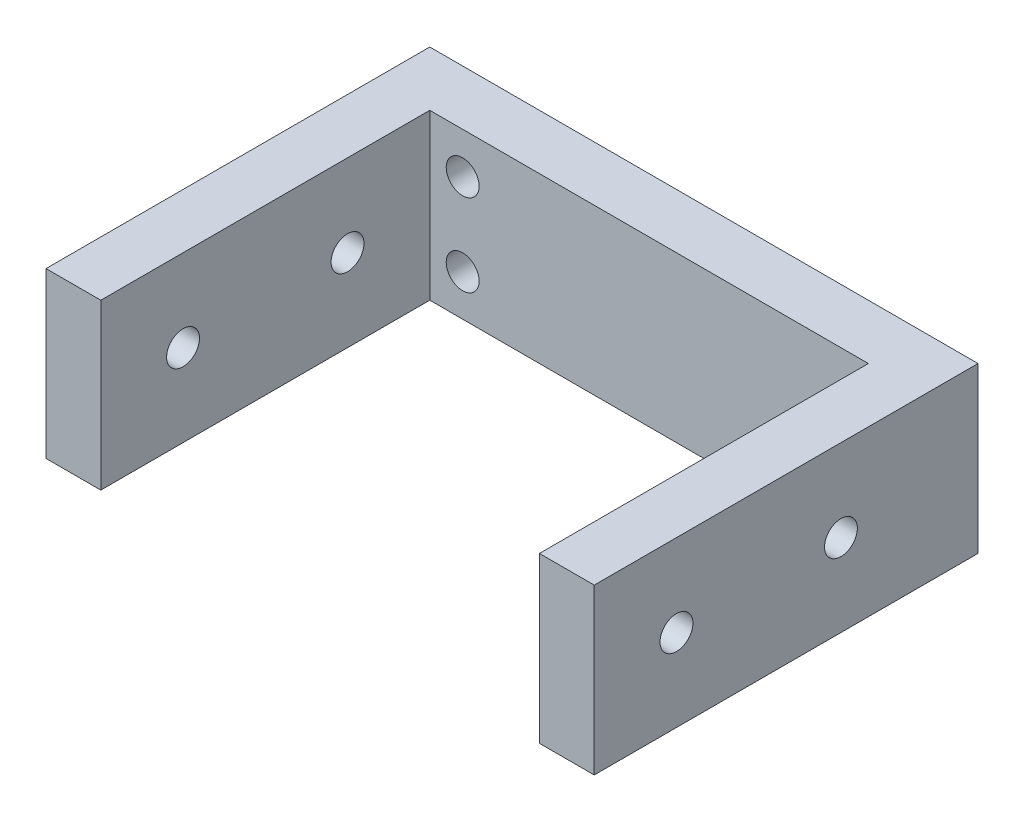
ISO-10303-21;
HEADER;
FILE_DESCRIPTION(('STEP AP214'),'2;1');
FILE_NAME('part.step','',(''),(''),'','','');
FILE_SCHEMA(('AUTOMOTIVE_DESIGN { 1 0 10303 214 1 1 1 1 }'));
ENDSEC;
DATA;
#1=APPLICATION_CONTEXT('core data for automotive mechanical design processes');
#2=APPLICATION_PROTOCOL_DEFINITION('international standard','automotive_design',2000,#1);
#3=PRODUCT_CONTEXT('',#1,'mechanical');
#4=PRODUCT('Part','Part','',(#3));
#5=PRODUCT_RELATED_PRODUCT_CATEGORY('part','',(#4));
#6=PRODUCT_DEFINITION_FORMATION('','',#4);
#7=PRODUCT_DEFINITION_CONTEXT('part definition',#1,'design');
#8=PRODUCT_DEFINITION('design','',#6,#7);
#9=PRODUCT_DEFINITION_SHAPE('','',#8);
#10=(LENGTH_UNIT() NAMED_UNIT(*) SI_UNIT(.MILLI.,.METRE.));
#11=(NAMED_UNIT(*) PLANE_ANGLE_UNIT() SI_UNIT($,.RADIAN.));
#12=(NAMED_UNIT(*) SI_UNIT($,.STERADIAN.) SOLID_ANGLE_UNIT());
#13=UNCERTAINTY_MEASURE_WITH_UNIT(LENGTH_MEASURE(1.E-05),#10,'distance_accuracy_value','');
#14=(GEOMETRIC_REPRESENTATION_CONTEXT(3) GLOBAL_UNCERTAINTY_ASSIGNED_CONTEXT((#13)) GLOBAL_UNIT_ASSIGNED_CONTEXT((#10,
#11,#12)) REPRESENTATION_CONTEXT('',''));
#15=CARTESIAN_POINT('',(0.,0.,0.));
#16=DIRECTION('',(0.,0.,1.));
#17=DIRECTION('',(1.,0.,0.));
#18=AXIS2_PLACEMENT_3D('',#15,#16,#17);
#19=CARTESIAN_POINT('',(0.,0.,2.5));
#20=DIRECTION('',(0.,0.,1.));
#21=DIRECTION('',(1.,0.,0.));
#22=AXIS2_PLACEMENT_3D('',#19,#20,#21);
#23=PLANE('',#22);
#24=CARTESIAN_POINT('',(-6.40402823537484,-7.32120847061245,2.5));
#25=DIRECTION('',(0.,0.,-1.));
#26=DIRECTION('',(-1.,0.,0.));
#27=AXIS2_PLACEMENT_3D('',#24,#25,#26);
#28=CIRCLE('',#27,1.5);
#29=CARTESIAN_POINT('',(-7.90402823537485,-7.32120847061245,2.5));
#30=VERTEX_POINT('',#29);
#31=EDGE_CURVE('E271',#30,#30,#28,.T.);
#32=ORIENTED_EDGE('',*,*,#31,.T.);
#33=EDGE_LOOP('',(#32));
#34=FACE_BOUND('',#33,.T.);
#35=CARTESIAN_POINT('',(-41.4040282353748,-3.57120847061245,2.5));
#36=DIRECTION('',(0.,0.,-1.));
#37=DIRECTION('',(-1.,0.,0.));
#38=AXIS2_PLACEMENT_3D('',#35,#36,#37);
#39=CIRCLE('',#38,1.5);
#40=CARTESIAN_POINT('',(-42.9040282353748,-3.57120847061245,2.5));
#41=VERTEX_POINT('',#40);
#42=EDGE_CURVE('E280',#41,#41,#39,.T.);
#43=ORIENTED_EDGE('',*,*,#42,.T.);
#44=EDGE_LOOP('',(#43));
#45=FACE_BOUND('',#44,.T.);
#46=CARTESIAN_POINT('',(-41.4040282353748,-11.0712084706125,2.5));
#47=DIRECTION('',(0.,0.,-1.));
#48=DIRECTION('',(-1.,0.,0.));
#49=AXIS2_PLACEMENT_3D('',#46,#47,#48);
#50=CIRCLE('',#49,1.5);
#51=CARTESIAN_POINT('',(-42.9040282353748,-11.0712084706125,2.5));
#52=VERTEX_POINT('',#51);
#53=EDGE_CURVE('E289',#52,#52,#50,.T.);
#54=ORIENTED_EDGE('',*,*,#53,.T.);
#55=EDGE_LOOP('',(#54));
#56=FACE_BOUND('',#55,.T.);
#57=DIRECTION('',(1.,0.,0.));
#58=VECTOR('',#57,1.);
#59=CARTESIAN_POINT('',(-49.4040282353748,-14.8212084706125,2.5));
#60=LINE('',#59,#58);
#61=CARTESIAN_POINT('',(-44.4040282353749,-14.8212084706125,2.5));
#62=VERTEX_POINT('',#61);
#63=CARTESIAN_POINT('',(-4.40402823537484,-14.8212084706125,2.5));
#64=VERTEX_POINT('',#63);
#65=EDGE_CURVE('E62',#62,#64,#60,.T.);
#66=ORIENTED_EDGE('',*,*,#65,.T.);
#67=DIRECTION('',(0.,-1.,0.));
#68=VECTOR('',#67,1.);
#69=CARTESIAN_POINT('',(-4.40402823537484,0.178791529387545,2.5));
#70=LINE('',#69,#68);
#71=CARTESIAN_POINT('',(-4.40402823537486,0.178791529387545,2.5));
#72=VERTEX_POINT('',#71);
#73=EDGE_CURVE('E57',#72,#64,#70,.T.);
#74=ORIENTED_EDGE('',*,*,#73,.F.);
#75=DIRECTION('',(-1.,0.,0.));
#76=VECTOR('',#75,1.);
#77=CARTESIAN_POINT('',(-49.4040282353748,0.178791529387545,2.5));
#78=LINE('',#77,#76);
#79=CARTESIAN_POINT('',(-44.4040282353749,0.178791529387545,2.5));
#80=VERTEX_POINT('',#79);
#81=EDGE_CURVE('E177',#72,#80,#78,.T.);
#82=ORIENTED_EDGE('',*,*,#81,.T.);
#83=DIRECTION('',(0.,1.,0.));
#84=VECTOR('',#83,1.);
#85=CARTESIAN_POINT('',(-44.4040282353749,-14.8212084706125,2.5));
#86=LINE('',#85,#84);
#87=EDGE_CURVE('E149',#62,#80,#86,.T.);
#88=ORIENTED_EDGE('',*,*,#87,.F.);
#89=EDGE_LOOP('',(#66,#74,#82,#88));
#90=FACE_BOUND('',#89,.T.);
#91=ADVANCED_FACE('F39',(#34,#45,#56,#90),#23,.T.);
#92=CARTESIAN_POINT('',(-49.4040282353748,0.178791529387545,-2.5));
#93=DIRECTION('',(-1.,0.,0.));
#94=DIRECTION('',(0.,-1.,0.));
#95=AXIS2_PLACEMENT_3D('',#92,#93,#94);
#96=PLANE('',#95);
#97=CARTESIAN_POINT('',(-49.4040282353748,-7.32120847061246,9.99999999999999));
#98=DIRECTION('',(-1.,0.,0.));
#99=DIRECTION('',(0.,-1.,0.));
#100=AXIS2_PLACEMENT_3D('',#97,#98,#99);
#101=CIRCLE('',#100,1.5);
#102=CARTESIAN_POINT('',(-49.4040282353748,-8.82120847061246,9.99999999999999));
#103=VERTEX_POINT('',#102);
#104=EDGE_CURVE('E308',#103,#103,#101,.T.);
#105=ORIENTED_EDGE('',*,*,#104,.F.);
#106=EDGE_LOOP('',(#105));
#107=FACE_BOUND('',#106,.T.);
#108=CARTESIAN_POINT('',(-49.4040282353748,-7.32120847061246,25.));
#109=DIRECTION('',(-1.,0.,0.));
#110=DIRECTION('',(0.,-1.,0.));
#111=AXIS2_PLACEMENT_3D('',#108,#109,#110);
#112=CIRCLE('',#111,1.5);
#113=CARTESIAN_POINT('',(-49.4040282353748,-8.82120847061246,25.));
#114=VERTEX_POINT('',#113);
#115=EDGE_CURVE('E136',#114,#114,#112,.T.);
#116=ORIENTED_EDGE('',*,*,#115,.F.);
#117=EDGE_LOOP('',(#116));
#118=FACE_BOUND('',#117,.T.);
#119=DIRECTION('',(0.,0.,1.));
#120=VECTOR('',#119,1.);
#121=CARTESIAN_POINT('',(-49.4040282353748,-14.8212084706125,-2.5));
#122=LINE('',#121,#120);
#123=CARTESIAN_POINT('',(-49.4040282353748,-14.8212084706125,-2.5));
#124=VERTEX_POINT('',#123);
#125=CARTESIAN_POINT('',(-49.4040282353748,-14.8212084706125,32.5));
#126=VERTEX_POINT('',#125);
#127=EDGE_CURVE('E43',#124,#126,#122,.T.);
#128=ORIENTED_EDGE('',*,*,#127,.T.);
#129=DIRECTION('',(0.,-1.,0.));
#130=VECTOR('',#129,1.);
#131=CARTESIAN_POINT('',(-49.4040282353748,-14.8212084706125,32.5));
#132=LINE('',#131,#130);
#133=CARTESIAN_POINT('',(-49.4040282353748,0.178791529387545,32.5));
#134=VERTEX_POINT('',#133);
#135=EDGE_CURVE('E150',#134,#126,#132,.T.);
#136=ORIENTED_EDGE('',*,*,#135,.F.);
#137=DIRECTION('',(0.,0.,1.));
#138=VECTOR('',#137,1.);
#139=CARTESIAN_POINT('',(-49.4040282353748,0.178791529387545,-2.5));
#140=LINE('',#139,#138);
#141=CARTESIAN_POINT('',(-49.4040282353748,0.178791529387545,-2.5));
#142=VERTEX_POINT('',#141);
#143=EDGE_CURVE('E11',#142,#134,#140,.T.);
#144=ORIENTED_EDGE('',*,*,#143,.F.);
#145=DIRECTION('',(0.,-1.,0.));
#146=VECTOR('',#145,1.);
#147=CARTESIAN_POINT('',(-49.4040282353748,0.178791529387545,-2.5));
#148=LINE('',#147,#146);
#149=EDGE_CURVE('E180',#142,#124,#148,.T.);
#150=ORIENTED_EDGE('',*,*,#149,.T.);
#151=EDGE_LOOP('',(#128,#136,#144,#150));
#152=FACE_BOUND('',#151,.T.);
#153=ADVANCED_FACE('F41',(#107,#118,#152),#96,.T.);
#154=CARTESIAN_POINT('',(-49.4040282353748,0.178791529387545,-2.5));
#155=DIRECTION('',(0.,1.,0.));
#156=DIRECTION('',(0.,0.,1.));
#157=AXIS2_PLACEMENT_3D('',#154,#155,#156);
#158=PLANE('',#157);
#159=ORIENTED_EDGE('',*,*,#143,.T.);
#160=DIRECTION('',(-1.,0.,0.));
#161=VECTOR('',#160,1.);
#162=CARTESIAN_POINT('',(-49.4040282353748,0.178791529387545,32.5));
#163=LINE('',#162,#161);
#164=CARTESIAN_POINT('',(-44.4040282353749,0.178791529387545,32.5));
#165=VERTEX_POINT('',#164);
#166=EDGE_CURVE('E160',#165,#134,#163,.T.);
#167=ORIENTED_EDGE('',*,*,#166,.F.);
#168=DIRECTION('',(0.,0.,-1.));
#169=VECTOR('',#168,1.);
#170=CARTESIAN_POINT('',(-44.4040282353749,0.178791529387545,32.5));
#171=LINE('',#170,#169);
#172=EDGE_CURVE('E164',#165,#80,#171,.T.);
#173=ORIENTED_EDGE('',*,*,#172,.T.);
#174=ORIENTED_EDGE('',*,*,#81,.F.);
#175=DIRECTION('',(0.,0.,-1.));
#176=VECTOR('',#175,1.);
#177=CARTESIAN_POINT('',(-4.40402823537484,0.178791529387545,32.5));
#178=LINE('',#177,#176);
#179=CARTESIAN_POINT('',(-4.40402823537484,0.178791529387545,32.5));
#180=VERTEX_POINT('',#179);
#181=EDGE_CURVE('E120',#180,#72,#178,.T.);
#182=ORIENTED_EDGE('',*,*,#181,.F.);
#183=DIRECTION('',(-1.,0.,0.));
#184=VECTOR('',#183,1.);
#185=CARTESIAN_POINT('',(0.595971764625156,0.178791529387545,32.5));
#186=LINE('',#185,#184);
#187=CARTESIAN_POINT('',(0.595971764625156,0.178791529387545,32.5));
#188=VERTEX_POINT('',#187);
#189=EDGE_CURVE('E117',#188,#180,#186,.T.);
#190=ORIENTED_EDGE('',*,*,#189,.F.);
#191=DIRECTION('',(0.,0.,1.));
#192=VECTOR('',#191,1.);
#193=CARTESIAN_POINT('',(0.595971764625156,0.178791529387545,-2.5));
#194=LINE('',#193,#192);
#195=CARTESIAN_POINT('',(0.595971764625156,0.178791529387545,-2.5));
#196=VERTEX_POINT('',#195);
#197=EDGE_CURVE('E49',#196,#188,#194,.T.);
#198=ORIENTED_EDGE('',*,*,#197,.F.);
#199=DIRECTION('',(-1.,0.,0.));
#200=VECTOR('',#199,1.);
#201=CARTESIAN_POINT('',(-49.4040282353748,0.178791529387545,-2.5));
#202=LINE('',#201,#200);
#203=EDGE_CURVE('E190',#196,#142,#202,.T.);
#204=ORIENTED_EDGE('',*,*,#203,.T.);
#205=EDGE_LOOP('',(#159,#167,#173,#174,#182,#190,#198,#204));
#206=FACE_BOUND('',#205,.T.);
#207=ADVANCED_FACE('F118',(#206),#158,.T.);
#208=CARTESIAN_POINT('',(0.595971764625156,0.178791529387545,-2.5));
#209=DIRECTION('',(1.,0.,0.));
#210=DIRECTION('',(0.,0.,-1.));
#211=AXIS2_PLACEMENT_3D('',#208,#209,#210);
#212=PLANE('',#211);
#213=CARTESIAN_POINT('',(0.595971764625152,-7.32120847061244,9.99999999999999));
#214=DIRECTION('',(1.,0.,0.));
#215=DIRECTION('',(0.,1.,0.));
#216=AXIS2_PLACEMENT_3D('',#213,#214,#215);
#217=CIRCLE('',#216,1.5);
#218=CARTESIAN_POINT('',(0.595971764625153,-5.82120847061243,9.99999999999999));
#219=VERTEX_POINT('',#218);
#220=EDGE_CURVE('E284',#219,#219,#217,.T.);
#221=ORIENTED_EDGE('',*,*,#220,.F.);
#222=EDGE_LOOP('',(#221));
#223=FACE_BOUND('',#222,.T.);
#224=CARTESIAN_POINT('',(0.595971764625152,-7.32120847061244,25.));
#225=DIRECTION('',(1.,0.,0.));
#226=DIRECTION('',(0.,1.,0.));
#227=AXIS2_PLACEMENT_3D('',#224,#225,#226);
#228=CIRCLE('',#227,1.5);
#229=CARTESIAN_POINT('',(0.595971764625153,-5.82120847061243,25.));
#230=VERTEX_POINT('',#229);
#231=EDGE_CURVE('E300',#230,#230,#228,.T.);
#232=ORIENTED_EDGE('',*,*,#231,.F.);
#233=EDGE_LOOP('',(#232));
#234=FACE_BOUND('',#233,.T.);
#235=ORIENTED_EDGE('',*,*,#197,.T.);
#236=DIRECTION('',(0.,1.,0.));
#237=VECTOR('',#236,1.);
#238=CARTESIAN_POINT('',(0.595971764625156,0.178791529387545,32.5));
#239=LINE('',#238,#237);
#240=CARTESIAN_POINT('',(0.595971764625156,-14.8212084706125,32.5));
#241=VERTEX_POINT('',#240);
#242=EDGE_CURVE('E107',#241,#188,#239,.T.);
#243=ORIENTED_EDGE('',*,*,#242,.F.);
#244=DIRECTION('',(0.,0.,1.));
#245=VECTOR('',#244,1.);
#246=CARTESIAN_POINT('',(0.595971764625156,-14.8212084706125,-2.5));
#247=LINE('',#246,#245);
#248=CARTESIAN_POINT('',(0.595971764625156,-14.8212084706125,-2.5));
#249=VERTEX_POINT('',#248);
#250=EDGE_CURVE('E114',#249,#241,#247,.T.);
#251=ORIENTED_EDGE('',*,*,#250,.F.);
#252=DIRECTION('',(0.,1.,0.));
#253=VECTOR('',#252,1.);
#254=CARTESIAN_POINT('',(0.595971764625156,0.178791529387545,-2.5));
#255=LINE('',#254,#253);
#256=EDGE_CURVE('E109',#249,#196,#255,.T.);
#257=ORIENTED_EDGE('',*,*,#256,.T.);
#258=EDGE_LOOP('',(#235,#243,#251,#257));
#259=FACE_BOUND('',#258,.T.);
#260=ADVANCED_FACE('F105',(#223,#234,#259),#212,.T.);
#261=CARTESIAN_POINT('',(-49.4040282353748,-14.8212084706125,-2.5));
#262=DIRECTION('',(0.,-1.,0.));
#263=DIRECTION('',(0.,0.,-1.));
#264=AXIS2_PLACEMENT_3D('',#261,#262,#263);
#265=PLANE('',#264);
#266=ORIENTED_EDGE('',*,*,#250,.T.);
#267=DIRECTION('',(1.,0.,0.));
#268=VECTOR('',#267,1.);
#269=CARTESIAN_POINT('',(0.595971764625156,-14.8212084706125,32.5));
#270=LINE('',#269,#268);
#271=CARTESIAN_POINT('',(-4.40402823537484,-14.8212084706125,32.5));
#272=VERTEX_POINT('',#271);
#273=EDGE_CURVE('E129',#272,#241,#270,.T.);
#274=ORIENTED_EDGE('',*,*,#273,.F.);
#275=DIRECTION('',(0.,0.,-1.));
#276=VECTOR('',#275,1.);
#277=CARTESIAN_POINT('',(-4.40402823537484,-14.8212084706125,32.5));
#278=LINE('',#277,#276);
#279=EDGE_CURVE('E142',#272,#64,#278,.T.);
#280=ORIENTED_EDGE('',*,*,#279,.T.);
#281=ORIENTED_EDGE('',*,*,#65,.F.);
#282=DIRECTION('',(0.,0.,-1.));
#283=VECTOR('',#282,1.);
#284=CARTESIAN_POINT('',(-44.4040282353749,-14.8212084706125,32.5));
#285=LINE('',#284,#283);
#286=CARTESIAN_POINT('',(-44.4040282353749,-14.8212084706125,32.5));
#287=VERTEX_POINT('',#286);
#288=EDGE_CURVE('E171',#287,#62,#285,.T.);
#289=ORIENTED_EDGE('',*,*,#288,.F.);
#290=DIRECTION('',(1.,0.,0.));
#291=VECTOR('',#290,1.);
#292=CARTESIAN_POINT('',(-49.4040282353748,-14.8212084706125,32.5));
#293=LINE('',#292,#291);
#294=EDGE_CURVE('E154',#126,#287,#293,.T.);
#295=ORIENTED_EDGE('',*,*,#294,.F.);
#296=ORIENTED_EDGE('',*,*,#127,.F.);
#297=DIRECTION('',(1.,0.,0.));
#298=VECTOR('',#297,1.);
#299=CARTESIAN_POINT('',(-49.4040282353748,-14.8212084706125,-2.5));
#300=LINE('',#299,#298);
#301=EDGE_CURVE('E184',#124,#249,#300,.T.);
#302=ORIENTED_EDGE('',*,*,#301,.T.);
#303=EDGE_LOOP('',(#266,#274,#280,#281,#289,#295,#296,#302));
#304=FACE_BOUND('',#303,.T.);
#305=ADVANCED_FACE('F201',(#304),#265,.T.);
#306=CARTESIAN_POINT('',(0.,0.,-2.5));
#307=DIRECTION('',(0.,0.,1.));
#308=DIRECTION('',(1.,0.,0.));
#309=AXIS2_PLACEMENT_3D('',#306,#307,#308);
#310=PLANE('',#309);
#311=CARTESIAN_POINT('',(-6.40402823537484,-7.32120847061245,-2.5));
#312=DIRECTION('',(0.,0.,-1.));
#313=DIRECTION('',(-1.,0.,0.));
#314=AXIS2_PLACEMENT_3D('',#311,#312,#313);
#315=CIRCLE('',#314,1.5);
#316=CARTESIAN_POINT('',(-7.90402823537485,-7.32120847061245,-2.5));
#317=VERTEX_POINT('',#316);
#318=EDGE_CURVE('E273',#317,#317,#315,.T.);
#319=ORIENTED_EDGE('',*,*,#318,.F.);
#320=EDGE_LOOP('',(#319));
#321=FACE_BOUND('',#320,.T.);
#322=CARTESIAN_POINT('',(-41.4040282353748,-3.57120847061245,-2.5));
#323=DIRECTION('',(0.,0.,-1.));
#324=DIRECTION('',(-1.,0.,0.));
#325=AXIS2_PLACEMENT_3D('',#322,#323,#324);
#326=CIRCLE('',#325,1.5);
#327=CARTESIAN_POINT('',(-42.9040282353748,-3.57120847061245,-2.5));
#328=VERTEX_POINT('',#327);
#329=EDGE_CURVE('E285',#328,#328,#326,.T.);
#330=ORIENTED_EDGE('',*,*,#329,.F.);
#331=EDGE_LOOP('',(#330));
#332=FACE_BOUND('',#331,.T.);
#333=CARTESIAN_POINT('',(-41.4040282353748,-11.0712084706125,-2.5));
#334=DIRECTION('',(0.,0.,-1.));
#335=DIRECTION('',(-1.,0.,0.));
#336=AXIS2_PLACEMENT_3D('',#333,#334,#335);
#337=CIRCLE('',#336,1.5);
#338=CARTESIAN_POINT('',(-42.9040282353748,-11.0712084706125,-2.5));
#339=VERTEX_POINT('',#338);
#340=EDGE_CURVE('E277',#339,#339,#337,.T.);
#341=ORIENTED_EDGE('',*,*,#340,.F.);
#342=EDGE_LOOP('',(#341));
#343=FACE_BOUND('',#342,.T.);
#344=ORIENTED_EDGE('',*,*,#149,.F.);
#345=ORIENTED_EDGE('',*,*,#203,.F.);
#346=ORIENTED_EDGE('',*,*,#256,.F.);
#347=ORIENTED_EDGE('',*,*,#301,.F.);
#348=EDGE_LOOP('',(#344,#345,#346,#347));
#349=FACE_BOUND('',#348,.T.);
#350=ADVANCED_FACE('F208',(#321,#332,#343,#349),#310,.F.);
#351=CARTESIAN_POINT('',(-44.4040282353749,-14.8212084706125,32.5));
#352=DIRECTION('',(-1.,0.,0.));
#353=DIRECTION('',(0.,0.,1.));
#354=AXIS2_PLACEMENT_3D('',#351,#352,#353);
#355=PLANE('',#354);
#356=CARTESIAN_POINT('',(-44.4040282353748,-7.32120847061246,9.99999999999999));
#357=DIRECTION('',(-1.,0.,0.));
#358=DIRECTION('',(0.,-1.,0.));
#359=AXIS2_PLACEMENT_3D('',#356,#357,#358);
#360=CIRCLE('',#359,1.5);
#361=CARTESIAN_POINT('',(-44.4040282353748,-8.82120847061246,9.99999999999999));
#362=VERTEX_POINT('',#361);
#363=EDGE_CURVE('E312',#362,#362,#360,.T.);
#364=ORIENTED_EDGE('',*,*,#363,.T.);
#365=EDGE_LOOP('',(#364));
#366=FACE_BOUND('',#365,.T.);
#367=CARTESIAN_POINT('',(-44.4040282353748,-7.32120847061246,25.));
#368=DIRECTION('',(-1.,0.,0.));
#369=DIRECTION('',(0.,-1.,0.));
#370=AXIS2_PLACEMENT_3D('',#367,#368,#369);
#371=CIRCLE('',#370,1.5);
#372=CARTESIAN_POINT('',(-44.4040282353748,-8.82120847061246,25.));
#373=VERTEX_POINT('',#372);
#374=EDGE_CURVE('E133',#373,#373,#371,.T.);
#375=ORIENTED_EDGE('',*,*,#374,.T.);
#376=EDGE_LOOP('',(#375));
#377=FACE_BOUND('',#376,.T.);
#378=ORIENTED_EDGE('',*,*,#87,.T.);
#379=ORIENTED_EDGE('',*,*,#172,.F.);
#380=DIRECTION('',(0.,1.,0.));
#381=VECTOR('',#380,1.);
#382=CARTESIAN_POINT('',(-44.4040282353749,-14.8212084706125,32.5));
#383=LINE('',#382,#381);
#384=EDGE_CURVE('E157',#287,#165,#383,.T.);
#385=ORIENTED_EDGE('',*,*,#384,.F.);
#386=ORIENTED_EDGE('',*,*,#288,.T.);
#387=EDGE_LOOP('',(#378,#379,#385,#386));
#388=FACE_BOUND('',#387,.T.);
#389=ADVANCED_FACE('F210',(#366,#377,#388),#355,.F.);
#390=CARTESIAN_POINT('',(0.,0.,32.5));
#391=DIRECTION('',(0.,0.,-1.));
#392=DIRECTION('',(-1.,0.,0.));
#393=AXIS2_PLACEMENT_3D('',#390,#391,#392);
#394=PLANE('',#393);
#395=ORIENTED_EDGE('',*,*,#135,.T.);
#396=ORIENTED_EDGE('',*,*,#294,.T.);
#397=ORIENTED_EDGE('',*,*,#384,.T.);
#398=ORIENTED_EDGE('',*,*,#166,.T.);
#399=EDGE_LOOP('',(#395,#396,#397,#398));
#400=FACE_BOUND('',#399,.T.);
#401=ADVANCED_FACE('F204',(#400),#394,.F.);
#402=CARTESIAN_POINT('',(-4.40402823537484,0.178791529387545,32.5));
#403=DIRECTION('',(1.,0.,0.));
#404=DIRECTION('',(0.,0.,-1.));
#405=AXIS2_PLACEMENT_3D('',#402,#403,#404);
#406=PLANE('',#405);
#407=CARTESIAN_POINT('',(-4.40402823537485,-7.32120847061243,9.99999999999999));
#408=DIRECTION('',(1.,0.,0.));
#409=DIRECTION('',(0.,1.,0.));
#410=AXIS2_PLACEMENT_3D('',#407,#408,#409);
#411=CIRCLE('',#410,1.5);
#412=CARTESIAN_POINT('',(-4.40402823537485,-5.82120847061243,9.99999999999999));
#413=VERTEX_POINT('',#412);
#414=EDGE_CURVE('E296',#413,#413,#411,.T.);
#415=ORIENTED_EDGE('',*,*,#414,.T.);
#416=EDGE_LOOP('',(#415));
#417=FACE_BOUND('',#416,.T.);
#418=CARTESIAN_POINT('',(-4.40402823537485,-7.32120847061243,25.));
#419=DIRECTION('',(1.,0.,0.));
#420=DIRECTION('',(0.,1.,0.));
#421=AXIS2_PLACEMENT_3D('',#418,#419,#420);
#422=CIRCLE('',#421,1.5);
#423=CARTESIAN_POINT('',(-4.40402823537485,-5.82120847061243,25.));
#424=VERTEX_POINT('',#423);
#425=EDGE_CURVE('E304',#424,#424,#422,.T.);
#426=ORIENTED_EDGE('',*,*,#425,.T.);
#427=EDGE_LOOP('',(#426));
#428=FACE_BOUND('',#427,.T.);
#429=ORIENTED_EDGE('',*,*,#73,.T.);
#430=ORIENTED_EDGE('',*,*,#279,.F.);
#431=DIRECTION('',(0.,-1.,0.));
#432=VECTOR('',#431,1.);
#433=CARTESIAN_POINT('',(-4.40402823537484,0.178791529387545,32.5));
#434=LINE('',#433,#432);
#435=EDGE_CURVE('E124',#180,#272,#434,.T.);
#436=ORIENTED_EDGE('',*,*,#435,.F.);
#437=ORIENTED_EDGE('',*,*,#181,.T.);
#438=EDGE_LOOP('',(#429,#430,#436,#437));
#439=FACE_BOUND('',#438,.T.);
#440=ADVANCED_FACE('F234',(#417,#428,#439),#406,.F.);
#441=CARTESIAN_POINT('',(0.,0.,32.5));
#442=DIRECTION('',(0.,0.,-1.));
#443=DIRECTION('',(-1.,0.,0.));
#444=AXIS2_PLACEMENT_3D('',#441,#442,#443);
#445=PLANE('',#444);
#446=ORIENTED_EDGE('',*,*,#242,.T.);
#447=ORIENTED_EDGE('',*,*,#189,.T.);
#448=ORIENTED_EDGE('',*,*,#435,.T.);
#449=ORIENTED_EDGE('',*,*,#273,.T.);
#450=EDGE_LOOP('',(#446,#447,#448,#449));
#451=FACE_BOUND('',#450,.T.);
#452=ADVANCED_FACE('F127',(#451),#445,.F.);
#453=CARTESIAN_POINT('',(-44.4040282353748,-7.32120847061246,25.));
#454=DIRECTION('',(-1.,0.,0.));
#455=DIRECTION('',(0.,-1.,0.));
#456=AXIS2_PLACEMENT_3D('',#453,#454,#455);
#457=CYLINDRICAL_SURFACE('',#456,1.5);
#458=ORIENTED_EDGE('',*,*,#374,.F.);
#459=EDGE_LOOP('',(#458));
#460=FACE_BOUND('',#459,.T.);
#461=ORIENTED_EDGE('',*,*,#115,.T.);
#462=EDGE_LOOP('',(#461));
#463=FACE_BOUND('',#462,.T.);
#464=ADVANCED_FACE('F240',(#460,#463),#457,.F.);
#465=CARTESIAN_POINT('',(-44.4040282353748,-7.32120847061246,9.99999999999999));
#466=DIRECTION('',(-1.,0.,0.));
#467=DIRECTION('',(0.,-1.,0.));
#468=AXIS2_PLACEMENT_3D('',#465,#466,#467);
#469=CYLINDRICAL_SURFACE('',#468,1.5);
#470=ORIENTED_EDGE('',*,*,#363,.F.);
#471=EDGE_LOOP('',(#470));
#472=FACE_BOUND('',#471,.T.);
#473=ORIENTED_EDGE('',*,*,#104,.T.);
#474=EDGE_LOOP('',(#473));
#475=FACE_BOUND('',#474,.T.);
#476=ADVANCED_FACE('F243',(#472,#475),#469,.F.);
#477=CARTESIAN_POINT('',(-4.40402823537485,-7.32120847061243,25.));
#478=DIRECTION('',(1.,0.,0.));
#479=DIRECTION('',(0.,1.,0.));
#480=AXIS2_PLACEMENT_3D('',#477,#478,#479);
#481=CYLINDRICAL_SURFACE('',#480,1.5);
#482=ORIENTED_EDGE('',*,*,#425,.F.);
#483=EDGE_LOOP('',(#482));
#484=FACE_BOUND('',#483,.T.);
#485=ORIENTED_EDGE('',*,*,#231,.T.);
#486=EDGE_LOOP('',(#485));
#487=FACE_BOUND('',#486,.T.);
#488=ADVANCED_FACE('F247',(#484,#487),#481,.F.);
#489=CARTESIAN_POINT('',(-4.40402823537485,-7.32120847061243,9.99999999999999));
#490=DIRECTION('',(1.,0.,0.));
#491=DIRECTION('',(0.,1.,0.));
#492=AXIS2_PLACEMENT_3D('',#489,#490,#491);
#493=CYLINDRICAL_SURFACE('',#492,1.5);
#494=ORIENTED_EDGE('',*,*,#414,.F.);
#495=EDGE_LOOP('',(#494));
#496=FACE_BOUND('',#495,.T.);
#497=ORIENTED_EDGE('',*,*,#220,.T.);
#498=EDGE_LOOP('',(#497));
#499=FACE_BOUND('',#498,.T.);
#500=ADVANCED_FACE('F251',(#496,#499),#493,.F.);
#501=CARTESIAN_POINT('',(-41.4040282353748,-11.0712084706125,2.5));
#502=DIRECTION('',(0.,0.,-1.));
#503=DIRECTION('',(-1.,0.,0.));
#504=AXIS2_PLACEMENT_3D('',#501,#502,#503);
#505=CYLINDRICAL_SURFACE('',#504,1.5);
#506=ORIENTED_EDGE('',*,*,#53,.F.);
#507=EDGE_LOOP('',(#506));
#508=FACE_BOUND('',#507,.T.);
#509=ORIENTED_EDGE('',*,*,#340,.T.);
#510=EDGE_LOOP('',(#509));
#511=FACE_BOUND('',#510,.T.);
#512=ADVANCED_FACE('F255',(#508,#511),#505,.F.);
#513=CARTESIAN_POINT('',(-41.4040282353748,-3.57120847061245,2.5));
#514=DIRECTION('',(0.,0.,-1.));
#515=DIRECTION('',(-1.,0.,0.));
#516=AXIS2_PLACEMENT_3D('',#513,#514,#515);
#517=CYLINDRICAL_SURFACE('',#516,1.5);
#518=ORIENTED_EDGE('',*,*,#42,.F.);
#519=EDGE_LOOP('',(#518));
#520=FACE_BOUND('',#519,.T.);
#521=ORIENTED_EDGE('',*,*,#329,.T.);
#522=EDGE_LOOP('',(#521));
#523=FACE_BOUND('',#522,.T.);
#524=ADVANCED_FACE('F259',(#520,#523),#517,.F.);
#525=CARTESIAN_POINT('',(-6.40402823537484,-7.32120847061245,2.5));
#526=DIRECTION('',(0.,0.,-1.));
#527=DIRECTION('',(-1.,0.,0.));
#528=AXIS2_PLACEMENT_3D('',#525,#526,#527);
#529=CYLINDRICAL_SURFACE('',#528,1.5);
#530=ORIENTED_EDGE('',*,*,#31,.F.);
#531=EDGE_LOOP('',(#530));
#532=FACE_BOUND('',#531,.T.);
#533=ORIENTED_EDGE('',*,*,#318,.T.);
#534=EDGE_LOOP('',(#533));
#535=FACE_BOUND('',#534,.T.);
#536=ADVANCED_FACE('F263',(#532,#535),#529,.F.);
#537=CLOSED_SHELL('',(#91,#153,#207,#260,#305,#350,#389,#401,#440,#452,#464,#476,#488,#500,#512,
#524,#536));
#538=MANIFOLD_SOLID_BREP('B2',#537);
#539=ADVANCED_BREP_SHAPE_REPRESENTATION('',(#18,#538),#14);
#540=SHAPE_DEFINITION_REPRESENTATION(#9,#539);
ENDSEC;
END-ISO-10303-21;
